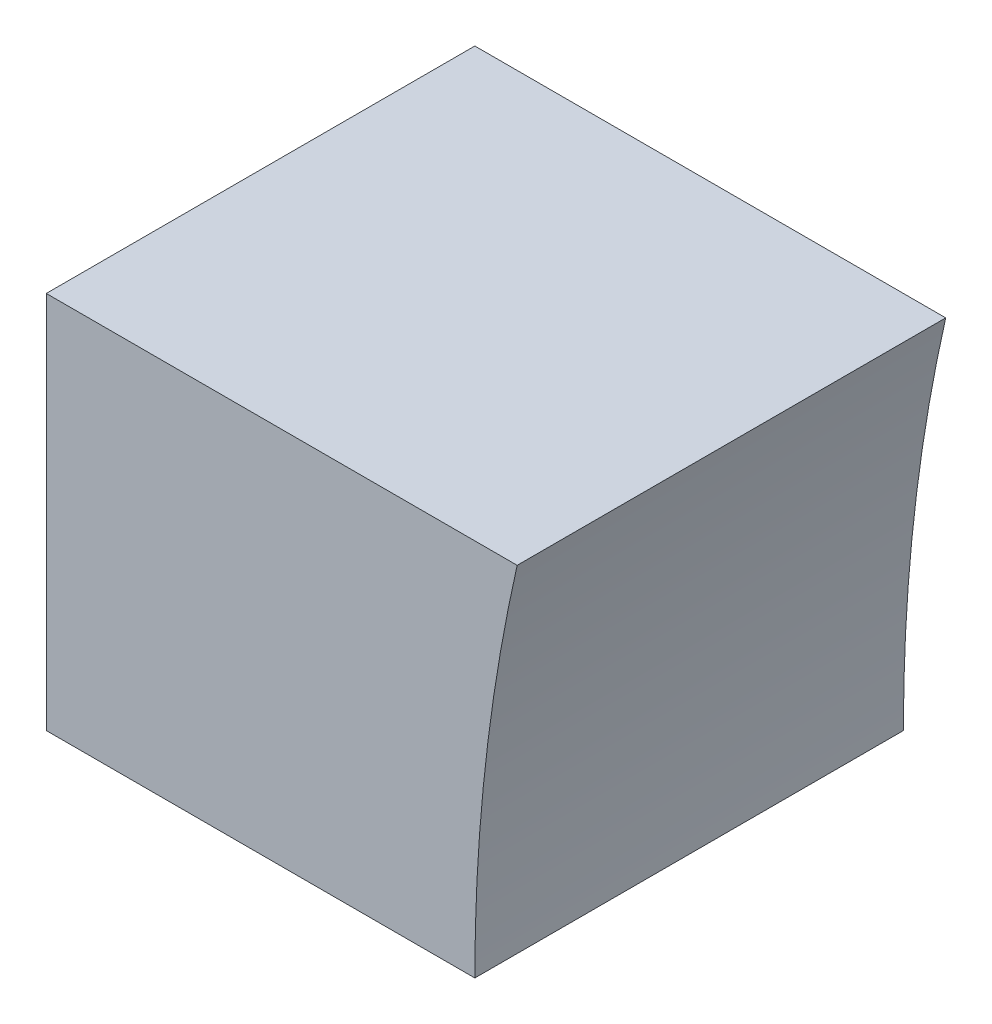
ISO-10303-21;
HEADER;
FILE_DESCRIPTION(('STEP AP214'),'2;1');
FILE_NAME('part.step','',(''),(''),'','','');
FILE_SCHEMA(('AUTOMOTIVE_DESIGN { 1 0 10303 214 1 1 1 1 }'));
ENDSEC;
DATA;
#1=APPLICATION_CONTEXT('core data for automotive mechanical design processes');
#2=APPLICATION_PROTOCOL_DEFINITION('international standard','automotive_design',2000,#1);
#3=PRODUCT_CONTEXT('',#1,'mechanical');
#4=PRODUCT('Part','Part','',(#3));
#5=PRODUCT_RELATED_PRODUCT_CATEGORY('part','',(#4));
#6=PRODUCT_DEFINITION_FORMATION('','',#4);
#7=PRODUCT_DEFINITION_CONTEXT('part definition',#1,'design');
#8=PRODUCT_DEFINITION('design','',#6,#7);
#9=PRODUCT_DEFINITION_SHAPE('','',#8);
#10=(LENGTH_UNIT() NAMED_UNIT(*) SI_UNIT(.MILLI.,.METRE.));
#11=(NAMED_UNIT(*) PLANE_ANGLE_UNIT() SI_UNIT($,.RADIAN.));
#12=(NAMED_UNIT(*) SI_UNIT($,.STERADIAN.) SOLID_ANGLE_UNIT());
#13=UNCERTAINTY_MEASURE_WITH_UNIT(LENGTH_MEASURE(1.E-05),#10,'distance_accuracy_value','');
#14=(GEOMETRIC_REPRESENTATION_CONTEXT(3) GLOBAL_UNCERTAINTY_ASSIGNED_CONTEXT((#13)) GLOBAL_UNIT_ASSIGNED_CONTEXT((#10,
#11,#12)) REPRESENTATION_CONTEXT('',''));
#15=CARTESIAN_POINT('',(0.,0.,0.));
#16=DIRECTION('',(0.,0.,1.));
#17=DIRECTION('',(1.,0.,0.));
#18=AXIS2_PLACEMENT_3D('',#15,#16,#17);
#19=CARTESIAN_POINT('',(-8112.,4992.,624.));
#20=DIRECTION('',(0.,0.,-1.));
#21=DIRECTION('',(-1.,0.,0.));
#22=AXIS2_PLACEMENT_3D('',#19,#20,#21);
#23=CYLINDRICAL_SURFACE('',#22,2496.);
#24=CARTESIAN_POINT('',(-8112.,4992.,0.));
#25=DIRECTION('',(0.,0.,1.));
#26=DIRECTION('',(1.,0.,0.));
#27=AXIS2_PLACEMENT_3D('',#24,#25,#26);
#28=CIRCLE('',#27,2496.);
#29=CARTESIAN_POINT('',(-10546.3776535287,5543.2,0.));
#30=VERTEX_POINT('',#29);
#31=CARTESIAN_POINT('',(-10608.,4992.,0.));
#32=VERTEX_POINT('',#31);
#33=EDGE_CURVE('E100',#30,#32,#28,.T.);
#34=ORIENTED_EDGE('',*,*,#33,.F.);
#35=DIRECTION('',(0.,0.,-1.));
#36=VECTOR('',#35,1.);
#37=CARTESIAN_POINT('',(-10546.3776535287,5543.2,624.));
#38=LINE('',#37,#36);
#39=CARTESIAN_POINT('',(-10546.3776535287,5543.2,624.));
#40=VERTEX_POINT('',#39);
#41=EDGE_CURVE('E11',#40,#30,#38,.T.);
#42=ORIENTED_EDGE('',*,*,#41,.F.);
#43=CARTESIAN_POINT('',(-8112.,4992.,624.));
#44=DIRECTION('',(0.,0.,1.));
#45=DIRECTION('',(1.,0.,0.));
#46=AXIS2_PLACEMENT_3D('',#43,#44,#45);
#47=CIRCLE('',#46,2496.);
#48=CARTESIAN_POINT('',(-10608.,4992.,624.));
#49=VERTEX_POINT('',#48);
#50=EDGE_CURVE('E93',#40,#49,#47,.T.);
#51=ORIENTED_EDGE('',*,*,#50,.T.);
#52=DIRECTION('',(0.,0.,-1.));
#53=VECTOR('',#52,1.);
#54=CARTESIAN_POINT('',(-10608.,4992.,624.));
#55=LINE('',#54,#53);
#56=EDGE_CURVE('E75',#49,#32,#55,.T.);
#57=ORIENTED_EDGE('',*,*,#56,.T.);
#58=EDGE_LOOP('',(#34,#42,#51,#57));
#59=FACE_BOUND('',#58,.T.);
#60=ADVANCED_FACE('F37',(#59),#23,.F.);
#61=CARTESIAN_POINT('',(0.,5543.2,624.));
#62=DIRECTION('',(0.,1.,0.));
#63=DIRECTION('',(0.,0.,1.));
#64=AXIS2_PLACEMENT_3D('',#61,#62,#63);
#65=PLANE('',#64);
#66=DIRECTION('',(1.,0.,0.));
#67=VECTOR('',#66,1.);
#68=CARTESIAN_POINT('',(0.,5543.2,0.));
#69=LINE('',#68,#67);
#70=CARTESIAN_POINT('',(-11232.,5543.2,0.));
#71=VERTEX_POINT('',#70);
#72=EDGE_CURVE('E86',#71,#30,#69,.T.);
#73=ORIENTED_EDGE('',*,*,#72,.F.);
#74=DIRECTION('',(0.,0.,-1.));
#75=VECTOR('',#74,1.);
#76=CARTESIAN_POINT('',(-11232.,5543.2,624.));
#77=LINE('',#76,#75);
#78=CARTESIAN_POINT('',(-11232.,5543.2,624.));
#79=VERTEX_POINT('',#78);
#80=EDGE_CURVE('E45',#79,#71,#77,.T.);
#81=ORIENTED_EDGE('',*,*,#80,.F.);
#82=DIRECTION('',(1.,0.,0.));
#83=VECTOR('',#82,1.);
#84=CARTESIAN_POINT('',(0.,5543.2,624.));
#85=LINE('',#84,#83);
#86=EDGE_CURVE('E84',#79,#40,#85,.T.);
#87=ORIENTED_EDGE('',*,*,#86,.T.);
#88=ORIENTED_EDGE('',*,*,#41,.T.);
#89=EDGE_LOOP('',(#73,#81,#87,#88));
#90=FACE_BOUND('',#89,.T.);
#91=ADVANCED_FACE('F83',(#90),#65,.T.);
#92=CARTESIAN_POINT('',(-11232.,-4.7056698160716E-11,624.));
#93=DIRECTION('',(-1.,0.,0.));
#94=DIRECTION('',(0.,-1.,0.));
#95=AXIS2_PLACEMENT_3D('',#92,#93,#94);
#96=PLANE('',#95);
#97=DIRECTION('',(0.,1.,0.));
#98=VECTOR('',#97,1.);
#99=CARTESIAN_POINT('',(-11232.,-4.7056698160716E-11,0.));
#100=LINE('',#99,#98);
#101=CARTESIAN_POINT('',(-11232.,4992.,0.));
#102=VERTEX_POINT('',#101);
#103=EDGE_CURVE('E104',#102,#71,#100,.T.);
#104=ORIENTED_EDGE('',*,*,#103,.F.);
#105=DIRECTION('',(0.,0.,-1.));
#106=VECTOR('',#105,1.);
#107=CARTESIAN_POINT('',(-11232.,4992.,624.));
#108=LINE('',#107,#106);
#109=CARTESIAN_POINT('',(-11232.,4992.,624.));
#110=VERTEX_POINT('',#109);
#111=EDGE_CURVE('E68',#110,#102,#108,.T.);
#112=ORIENTED_EDGE('',*,*,#111,.F.);
#113=DIRECTION('',(0.,1.,0.));
#114=VECTOR('',#113,1.);
#115=CARTESIAN_POINT('',(-11232.,-4.7056698160716E-11,624.));
#116=LINE('',#115,#114);
#117=EDGE_CURVE('E92',#110,#79,#116,.T.);
#118=ORIENTED_EDGE('',*,*,#117,.T.);
#119=ORIENTED_EDGE('',*,*,#80,.T.);
#120=EDGE_LOOP('',(#104,#112,#118,#119));
#121=FACE_BOUND('',#120,.T.);
#122=ADVANCED_FACE('F95',(#121),#96,.T.);
#123=CARTESIAN_POINT('',(0.,4992.,624.));
#124=DIRECTION('',(0.,1.,0.));
#125=DIRECTION('',(0.,0.,1.));
#126=AXIS2_PLACEMENT_3D('',#123,#124,#125);
#127=PLANE('',#126);
#128=DIRECTION('',(1.,0.,0.));
#129=VECTOR('',#128,1.);
#130=CARTESIAN_POINT('',(0.,4992.,0.));
#131=LINE('',#130,#129);
#132=EDGE_CURVE('E106',#102,#32,#131,.T.);
#133=ORIENTED_EDGE('',*,*,#132,.T.);
#134=ORIENTED_EDGE('',*,*,#56,.F.);
#135=DIRECTION('',(1.,0.,0.));
#136=VECTOR('',#135,1.);
#137=CARTESIAN_POINT('',(0.,4992.,624.));
#138=LINE('',#137,#136);
#139=EDGE_CURVE('E53',#110,#49,#138,.T.);
#140=ORIENTED_EDGE('',*,*,#139,.F.);
#141=ORIENTED_EDGE('',*,*,#111,.T.);
#142=EDGE_LOOP('',(#133,#134,#140,#141));
#143=FACE_BOUND('',#142,.T.);
#144=ADVANCED_FACE('F116',(#143),#127,.F.);
#145=CARTESIAN_POINT('',(0.,0.,624.));
#146=DIRECTION('',(0.,0.,1.));
#147=DIRECTION('',(1.,0.,0.));
#148=AXIS2_PLACEMENT_3D('',#145,#146,#147);
#149=PLANE('',#148);
#150=ORIENTED_EDGE('',*,*,#50,.F.);
#151=ORIENTED_EDGE('',*,*,#86,.F.);
#152=ORIENTED_EDGE('',*,*,#117,.F.);
#153=ORIENTED_EDGE('',*,*,#139,.T.);
#154=EDGE_LOOP('',(#150,#151,#152,#153));
#155=FACE_BOUND('',#154,.T.);
#156=ADVANCED_FACE('F91',(#155),#149,.T.);
#157=CARTESIAN_POINT('',(0.,0.,0.));
#158=DIRECTION('',(0.,0.,1.));
#159=DIRECTION('',(1.,0.,0.));
#160=AXIS2_PLACEMENT_3D('',#157,#158,#159);
#161=PLANE('',#160);
#162=ORIENTED_EDGE('',*,*,#33,.T.);
#163=ORIENTED_EDGE('',*,*,#132,.F.);
#164=ORIENTED_EDGE('',*,*,#103,.T.);
#165=ORIENTED_EDGE('',*,*,#72,.T.);
#166=EDGE_LOOP('',(#162,#163,#164,#165));
#167=FACE_BOUND('',#166,.T.);
#168=ADVANCED_FACE('F121',(#167),#161,.F.);
#169=CLOSED_SHELL('',(#60,#91,#122,#144,#156,#168));
#170=MANIFOLD_SOLID_BREP('B2',#169);
#171=ADVANCED_BREP_SHAPE_REPRESENTATION('',(#18,#170),#14);
#172=SHAPE_DEFINITION_REPRESENTATION(#9,#171);
ENDSEC;
END-ISO-10303-21;
